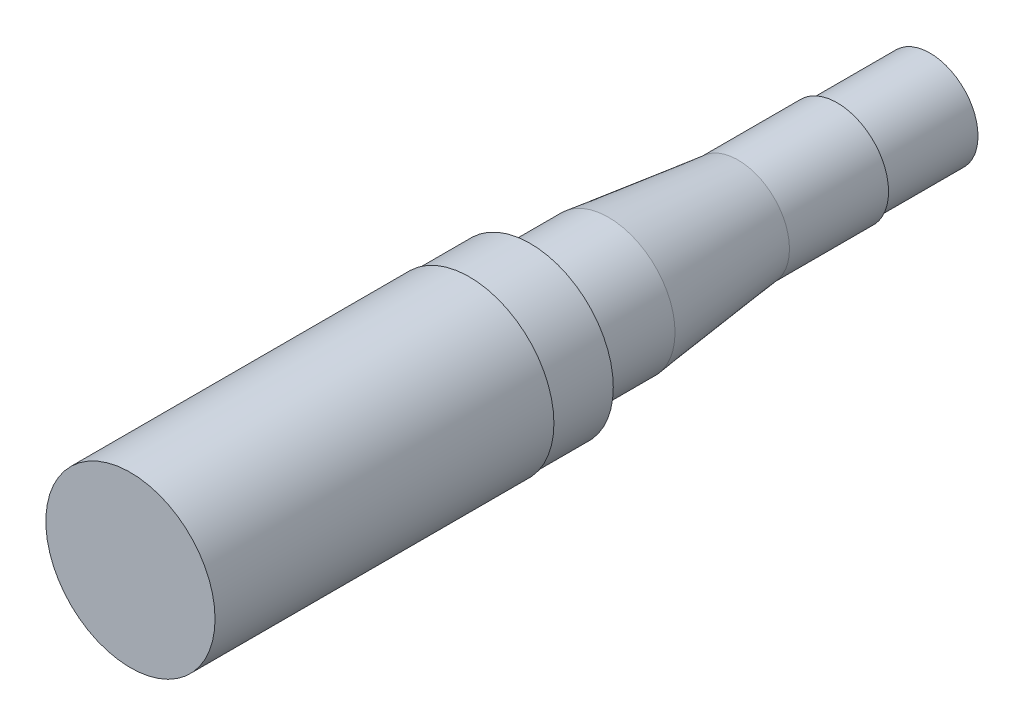
ISO-10303-21;
HEADER;
FILE_DESCRIPTION(('STEP AP214'),'2;1');
FILE_NAME('part.step','',(''),(''),'','','');
FILE_SCHEMA(('AUTOMOTIVE_DESIGN { 1 0 10303 214 1 1 1 1 }'));
ENDSEC;
DATA;
#1=APPLICATION_CONTEXT('core data for automotive mechanical design processes');
#2=APPLICATION_PROTOCOL_DEFINITION('international standard','automotive_design',2000,#1);
#3=PRODUCT_CONTEXT('',#1,'mechanical');
#4=PRODUCT('Part','Part','',(#3));
#5=PRODUCT_RELATED_PRODUCT_CATEGORY('part','',(#4));
#6=PRODUCT_DEFINITION_FORMATION('','',#4);
#7=PRODUCT_DEFINITION_CONTEXT('part definition',#1,'design');
#8=PRODUCT_DEFINITION('design','',#6,#7);
#9=PRODUCT_DEFINITION_SHAPE('','',#8);
#10=(LENGTH_UNIT() NAMED_UNIT(*) SI_UNIT(.MILLI.,.METRE.));
#11=(NAMED_UNIT(*) PLANE_ANGLE_UNIT() SI_UNIT($,.RADIAN.));
#12=(NAMED_UNIT(*) SI_UNIT($,.STERADIAN.) SOLID_ANGLE_UNIT());
#13=UNCERTAINTY_MEASURE_WITH_UNIT(LENGTH_MEASURE(1.E-05),#10,'distance_accuracy_value','');
#14=(GEOMETRIC_REPRESENTATION_CONTEXT(3) GLOBAL_UNCERTAINTY_ASSIGNED_CONTEXT((#13)) GLOBAL_UNIT_ASSIGNED_CONTEXT((#10,
#11,#12)) REPRESENTATION_CONTEXT('',''));
#15=CARTESIAN_POINT('',(0.,0.,0.));
#16=DIRECTION('',(0.,0.,1.));
#17=DIRECTION('',(1.,0.,0.));
#18=AXIS2_PLACEMENT_3D('',#15,#16,#17);
#19=CARTESIAN_POINT('',(0.,-12.5984,-210.058));
#20=DIRECTION('',(0.,0.,1.));
#21=DIRECTION('',(1.,0.,0.));
#22=AXIS2_PLACEMENT_3D('',#19,#20,#21);
#23=PLANE('',#22);
#24=CARTESIAN_POINT('',(0.,0.,-210.058));
#25=DIRECTION('',(0.,0.,1.));
#26=DIRECTION('',(1.,0.,0.));
#27=AXIS2_PLACEMENT_3D('',#24,#25,#26);
#28=CIRCLE('',#27,12.5984);
#29=CARTESIAN_POINT('',(12.5984,0.,-210.058));
#30=VERTEX_POINT('',#29);
#31=EDGE_CURVE('E10',#30,#30,#28,.T.);
#32=ORIENTED_EDGE('',*,*,#31,.F.);
#33=EDGE_LOOP('',(#32));
#34=FACE_BOUND('',#33,.T.);
#35=ADVANCED_FACE('F37',(#34),#23,.F.);
#36=CARTESIAN_POINT('',(0.,0.,0.));
#37=DIRECTION('',(0.,0.,1.));
#38=DIRECTION('',(1.,0.,0.));
#39=AXIS2_PLACEMENT_3D('',#36,#37,#38);
#40=CYLINDRICAL_SURFACE('',#39,12.5984);
#41=CARTESIAN_POINT('',(0.,0.,-186.309));
#42=DIRECTION('',(0.,0.,1.));
#43=DIRECTION('',(1.,0.,0.));
#44=AXIS2_PLACEMENT_3D('',#41,#42,#43);
#45=CIRCLE('',#44,12.5984);
#46=CARTESIAN_POINT('',(12.5984,0.,-186.309));
#47=VERTEX_POINT('',#46);
#48=EDGE_CURVE('E44',#47,#47,#45,.T.);
#49=ORIENTED_EDGE('',*,*,#48,.F.);
#50=EDGE_LOOP('',(#49));
#51=FACE_BOUND('',#50,.T.);
#52=ORIENTED_EDGE('',*,*,#31,.T.);
#53=EDGE_LOOP('',(#52));
#54=FACE_BOUND('',#53,.T.);
#55=ADVANCED_FACE('F145',(#51,#54),#40,.T.);
#56=CARTESIAN_POINT('',(0.,0.,-186.309));
#57=DIRECTION('',(0.,0.,1.));
#58=DIRECTION('',(1.,0.,0.));
#59=AXIS2_PLACEMENT_3D('',#56,#57,#58);
#60=TOROIDAL_SURFACE('',#59,13.2334,0.634999999999998);
#61=CARTESIAN_POINT('',(0.,0.,-185.674));
#62=DIRECTION('',(0.,0.,1.));
#63=DIRECTION('',(1.,0.,0.));
#64=AXIS2_PLACEMENT_3D('',#61,#62,#63);
#65=CIRCLE('',#64,13.2334);
#66=CARTESIAN_POINT('',(13.2334,0.,-185.674));
#67=VERTEX_POINT('',#66);
#68=EDGE_CURVE('E49',#67,#67,#65,.T.);
#69=ORIENTED_EDGE('',*,*,#68,.F.);
#70=EDGE_LOOP('',(#69));
#71=FACE_BOUND('',#70,.T.);
#72=ORIENTED_EDGE('',*,*,#48,.T.);
#73=EDGE_LOOP('',(#72));
#74=FACE_BOUND('',#73,.T.);
#75=ADVANCED_FACE('F140',(#71,#74),#60,.F.);
#76=CARTESIAN_POINT('',(0.,-13.4874,-185.674));
#77=DIRECTION('',(0.,0.,1.));
#78=DIRECTION('',(1.,0.,0.));
#79=AXIS2_PLACEMENT_3D('',#76,#77,#78);
#80=PLANE('',#79);
#81=CARTESIAN_POINT('',(0.,0.,-185.674));
#82=DIRECTION('',(0.,0.,1.));
#83=DIRECTION('',(1.,0.,0.));
#84=AXIS2_PLACEMENT_3D('',#81,#82,#83);
#85=CIRCLE('',#84,13.4874);
#86=CARTESIAN_POINT('',(13.4874,0.,-185.674));
#87=VERTEX_POINT('',#86);
#88=EDGE_CURVE('E54',#87,#87,#85,.T.);
#89=ORIENTED_EDGE('',*,*,#88,.F.);
#90=EDGE_LOOP('',(#89));
#91=FACE_BOUND('',#90,.T.);
#92=ORIENTED_EDGE('',*,*,#68,.T.);
#93=EDGE_LOOP('',(#92));
#94=FACE_BOUND('',#93,.T.);
#95=ADVANCED_FACE('F134',(#91,#94),#80,.F.);
#96=CARTESIAN_POINT('',(0.,0.,0.));
#97=DIRECTION('',(0.,0.,1.));
#98=DIRECTION('',(1.,0.,0.));
#99=AXIS2_PLACEMENT_3D('',#96,#97,#98);
#100=CYLINDRICAL_SURFACE('',#99,13.4874);
#101=CARTESIAN_POINT('',(0.,0.,-159.639));
#102=DIRECTION('',(0.,0.,1.));
#103=DIRECTION('',(1.,0.,0.));
#104=AXIS2_PLACEMENT_3D('',#101,#102,#103);
#105=CIRCLE('',#104,13.4874);
#106=CARTESIAN_POINT('',(13.4874,0.,-159.639));
#107=VERTEX_POINT('',#106);
#108=EDGE_CURVE('E60',#107,#107,#105,.T.);
#109=ORIENTED_EDGE('',*,*,#108,.F.);
#110=EDGE_LOOP('',(#109));
#111=FACE_BOUND('',#110,.T.);
#112=ORIENTED_EDGE('',*,*,#88,.T.);
#113=EDGE_LOOP('',(#112));
#114=FACE_BOUND('',#113,.T.);
#115=ADVANCED_FACE('F128',(#111,#114),#100,.T.);
#116=CARTESIAN_POINT('',(0.,0.,-159.639));
#117=DIRECTION('',(0.,0.,1.));
#118=DIRECTION('',(1.,0.,0.));
#119=AXIS2_PLACEMENT_3D('',#116,#117,#118);
#120=CONICAL_SURFACE('',#119,13.4874,0.116264333041064);
#121=CARTESIAN_POINT('',(0.,0.,-125.603));
#122=DIRECTION('',(0.,0.,1.));
#123=DIRECTION('',(1.,0.,0.));
#124=AXIS2_PLACEMENT_3D('',#121,#122,#123);
#125=CIRCLE('',#124,17.4625);
#126=CARTESIAN_POINT('',(17.4625,0.,-125.603));
#127=VERTEX_POINT('',#126);
#128=EDGE_CURVE('E63',#127,#127,#125,.T.);
#129=ORIENTED_EDGE('',*,*,#128,.F.);
#130=EDGE_LOOP('',(#129));
#131=FACE_BOUND('',#130,.T.);
#132=ORIENTED_EDGE('',*,*,#108,.T.);
#133=EDGE_LOOP('',(#132));
#134=FACE_BOUND('',#133,.T.);
#135=ADVANCED_FACE('F122',(#131,#134),#120,.T.);
#136=CARTESIAN_POINT('',(0.,0.,0.));
#137=DIRECTION('',(0.,0.,1.));
#138=DIRECTION('',(1.,0.,0.));
#139=AXIS2_PLACEMENT_3D('',#136,#137,#138);
#140=CYLINDRICAL_SURFACE('',#139,17.4625);
#141=CARTESIAN_POINT('',(0.,0.,-106.934));
#142=DIRECTION('',(0.,0.,1.));
#143=DIRECTION('',(1.,0.,0.));
#144=AXIS2_PLACEMENT_3D('',#141,#142,#143);
#145=CIRCLE('',#144,17.4625);
#146=CARTESIAN_POINT('',(17.4625,0.,-106.934));
#147=VERTEX_POINT('',#146);
#148=EDGE_CURVE('E66',#147,#147,#145,.T.);
#149=ORIENTED_EDGE('',*,*,#148,.F.);
#150=EDGE_LOOP('',(#149));
#151=FACE_BOUND('',#150,.T.);
#152=ORIENTED_EDGE('',*,*,#128,.T.);
#153=EDGE_LOOP('',(#152));
#154=FACE_BOUND('',#153,.T.);
#155=ADVANCED_FACE('F116',(#151,#154),#140,.T.);
#156=CARTESIAN_POINT('',(0.,0.,-106.934));
#157=DIRECTION('',(0.,0.,1.));
#158=DIRECTION('',(1.,0.,0.));
#159=AXIS2_PLACEMENT_3D('',#156,#157,#158);
#160=TOROIDAL_SURFACE('',#159,19.3675,1.905);
#161=CARTESIAN_POINT('',(0.,0.,-105.029));
#162=DIRECTION('',(0.,0.,1.));
#163=DIRECTION('',(1.,0.,0.));
#164=AXIS2_PLACEMENT_3D('',#161,#162,#163);
#165=CIRCLE('',#164,19.3675);
#166=CARTESIAN_POINT('',(19.3675,0.,-105.029));
#167=VERTEX_POINT('',#166);
#168=EDGE_CURVE('E69',#167,#167,#165,.T.);
#169=ORIENTED_EDGE('',*,*,#168,.F.);
#170=EDGE_LOOP('',(#169));
#171=FACE_BOUND('',#170,.T.);
#172=ORIENTED_EDGE('',*,*,#148,.T.);
#173=EDGE_LOOP('',(#172));
#174=FACE_BOUND('',#173,.T.);
#175=ADVANCED_FACE('F110',(#171,#174),#160,.F.);
#176=CARTESIAN_POINT('',(1.52358469479366E-13,-21.8186,-105.029));
#177=DIRECTION('',(0.,0.,1.));
#178=DIRECTION('',(1.,0.,0.));
#179=AXIS2_PLACEMENT_3D('',#176,#177,#178);
#180=PLANE('',#179);
#181=CARTESIAN_POINT('',(0.,0.,-105.029));
#182=DIRECTION('',(0.,0.,1.));
#183=DIRECTION('',(1.,0.,0.));
#184=AXIS2_PLACEMENT_3D('',#181,#182,#183);
#185=CIRCLE('',#184,21.8186);
#186=CARTESIAN_POINT('',(21.8186,0.,-105.029));
#187=VERTEX_POINT('',#186);
#188=EDGE_CURVE('E72',#187,#187,#185,.T.);
#189=ORIENTED_EDGE('',*,*,#188,.F.);
#190=EDGE_LOOP('',(#189));
#191=FACE_BOUND('',#190,.T.);
#192=ORIENTED_EDGE('',*,*,#168,.T.);
#193=EDGE_LOOP('',(#192));
#194=FACE_BOUND('',#193,.T.);
#195=ADVANCED_FACE('F104',(#191,#194),#180,.F.);
#196=CARTESIAN_POINT('',(0.,0.,0.));
#197=DIRECTION('',(0.,0.,1.));
#198=DIRECTION('',(1.,0.,0.));
#199=AXIS2_PLACEMENT_3D('',#196,#197,#198);
#200=CYLINDRICAL_SURFACE('',#199,21.8186);
#201=CARTESIAN_POINT('',(0.,0.,-89.027));
#202=DIRECTION('',(0.,0.,1.));
#203=DIRECTION('',(1.,0.,0.));
#204=AXIS2_PLACEMENT_3D('',#201,#202,#203);
#205=CIRCLE('',#204,21.8186);
#206=CARTESIAN_POINT('',(21.8186,0.,-89.027));
#207=VERTEX_POINT('',#206);
#208=EDGE_CURVE('E75',#207,#207,#205,.T.);
#209=ORIENTED_EDGE('',*,*,#208,.F.);
#210=EDGE_LOOP('',(#209));
#211=FACE_BOUND('',#210,.T.);
#212=ORIENTED_EDGE('',*,*,#188,.T.);
#213=EDGE_LOOP('',(#212));
#214=FACE_BOUND('',#213,.T.);
#215=ADVANCED_FACE('F98',(#211,#214),#200,.T.);
#216=CARTESIAN_POINT('',(1.55196345511577E-13,-22.225,-89.027));
#217=DIRECTION('',(0.,0.,1.));
#218=DIRECTION('',(1.,0.,0.));
#219=AXIS2_PLACEMENT_3D('',#216,#217,#218);
#220=PLANE('',#219);
#221=CARTESIAN_POINT('',(0.,0.,-89.027));
#222=DIRECTION('',(0.,0.,1.));
#223=DIRECTION('',(1.,0.,0.));
#224=AXIS2_PLACEMENT_3D('',#221,#222,#223);
#225=CIRCLE('',#224,22.225);
#226=CARTESIAN_POINT('',(22.225,0.,-89.027));
#227=VERTEX_POINT('',#226);
#228=EDGE_CURVE('E79',#227,#227,#225,.T.);
#229=ORIENTED_EDGE('',*,*,#228,.F.);
#230=EDGE_LOOP('',(#229));
#231=FACE_BOUND('',#230,.T.);
#232=ORIENTED_EDGE('',*,*,#208,.T.);
#233=EDGE_LOOP('',(#232));
#234=FACE_BOUND('',#233,.T.);
#235=ADVANCED_FACE('F92',(#231,#234),#220,.F.);
#236=CARTESIAN_POINT('',(0.,0.,0.));
#237=DIRECTION('',(0.,0.,1.));
#238=DIRECTION('',(1.,0.,0.));
#239=AXIS2_PLACEMENT_3D('',#236,#237,#238);
#240=CYLINDRICAL_SURFACE('',#239,22.225);
#241=CARTESIAN_POINT('',(0.,0.,0.));
#242=DIRECTION('',(0.,0.,1.));
#243=DIRECTION('',(1.,0.,0.));
#244=AXIS2_PLACEMENT_3D('',#241,#242,#243);
#245=CIRCLE('',#244,22.225);
#246=CARTESIAN_POINT('',(22.225,0.,0.));
#247=VERTEX_POINT('',#246);
#248=EDGE_CURVE('E83',#247,#247,#245,.T.);
#249=ORIENTED_EDGE('',*,*,#248,.F.);
#250=EDGE_LOOP('',(#249));
#251=FACE_BOUND('',#250,.T.);
#252=ORIENTED_EDGE('',*,*,#228,.T.);
#253=EDGE_LOOP('',(#252));
#254=FACE_BOUND('',#253,.T.);
#255=ADVANCED_FACE('F89',(#251,#254),#240,.T.);
#256=CARTESIAN_POINT('',(0.,0.,0.));
#257=DIRECTION('',(0.,0.,-1.));
#258=DIRECTION('',(-1.,0.,0.));
#259=AXIS2_PLACEMENT_3D('',#256,#257,#258);
#260=PLANE('',#259);
#261=ORIENTED_EDGE('',*,*,#248,.T.);
#262=EDGE_LOOP('',(#261));
#263=FACE_BOUND('',#262,.T.);
#264=ADVANCED_FACE('F87',(#263),#260,.F.);
#265=CLOSED_SHELL('',(#35,#55,#75,#95,#115,#135,#155,#175,#195,#215,#235,#255,#264));
#266=MANIFOLD_SOLID_BREP('B2',#265);
#267=ADVANCED_BREP_SHAPE_REPRESENTATION('',(#18,#266),#14);
#268=SHAPE_DEFINITION_REPRESENTATION(#9,#267);
ENDSEC;
END-ISO-10303-21;
